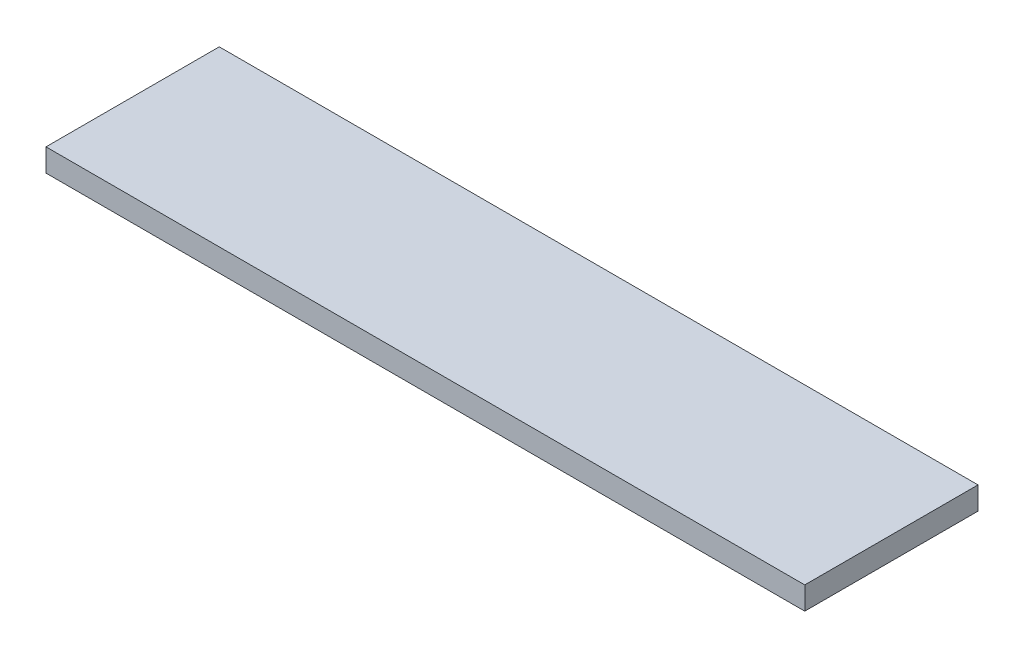
ISO-10303-21;
HEADER;
FILE_DESCRIPTION(('STEP AP214'),'2;1');
FILE_NAME('part.step','',(''),(''),'','','');
FILE_SCHEMA(('AUTOMOTIVE_DESIGN { 1 0 10303 214 1 1 1 1 }'));
ENDSEC;
DATA;
#1=APPLICATION_CONTEXT('core data for automotive mechanical design processes');
#2=APPLICATION_PROTOCOL_DEFINITION('international standard','automotive_design',2000,#1);
#3=PRODUCT_CONTEXT('',#1,'mechanical');
#4=PRODUCT('Part','Part','',(#3));
#5=PRODUCT_RELATED_PRODUCT_CATEGORY('part','',(#4));
#6=PRODUCT_DEFINITION_FORMATION('','',#4);
#7=PRODUCT_DEFINITION_CONTEXT('part definition',#1,'design');
#8=PRODUCT_DEFINITION('design','',#6,#7);
#9=PRODUCT_DEFINITION_SHAPE('','',#8);
#10=(LENGTH_UNIT() NAMED_UNIT(*) SI_UNIT(.MILLI.,.METRE.));
#11=(NAMED_UNIT(*) PLANE_ANGLE_UNIT() SI_UNIT($,.RADIAN.));
#12=(NAMED_UNIT(*) SI_UNIT($,.STERADIAN.) SOLID_ANGLE_UNIT());
#13=UNCERTAINTY_MEASURE_WITH_UNIT(LENGTH_MEASURE(1.E-05),#10,'distance_accuracy_value','');
#14=(GEOMETRIC_REPRESENTATION_CONTEXT(3) GLOBAL_UNCERTAINTY_ASSIGNED_CONTEXT((#13)) GLOBAL_UNIT_ASSIGNED_CONTEXT((#10,
#11,#12)) REPRESENTATION_CONTEXT('',''));
#15=CARTESIAN_POINT('',(0.,0.,0.));
#16=DIRECTION('',(0.,0.,1.));
#17=DIRECTION('',(1.,0.,0.));
#18=AXIS2_PLACEMENT_3D('',#15,#16,#17);
#19=CARTESIAN_POINT('',(-300.,18.,68.5));
#20=DIRECTION('',(1.,0.,0.));
#21=DIRECTION('',(0.,0.,-1.));
#22=AXIS2_PLACEMENT_3D('',#19,#20,#21);
#23=PLANE('',#22);
#24=DIRECTION('',(0.,0.,1.));
#25=VECTOR('',#24,1.);
#26=CARTESIAN_POINT('',(-300.,0.,68.5));
#27=LINE('',#26,#25);
#28=CARTESIAN_POINT('',(-300.,0.,-68.5));
#29=VERTEX_POINT('',#28);
#30=CARTESIAN_POINT('',(-300.,0.,68.5));
#31=VERTEX_POINT('',#30);
#32=EDGE_CURVE('E98',#29,#31,#27,.T.);
#33=ORIENTED_EDGE('',*,*,#32,.T.);
#34=DIRECTION('',(0.,-1.,0.));
#35=VECTOR('',#34,1.);
#36=CARTESIAN_POINT('',(-300.,18.,68.5));
#37=LINE('',#36,#35);
#38=CARTESIAN_POINT('',(-300.,18.,68.5));
#39=VERTEX_POINT('',#38);
#40=EDGE_CURVE('E11',#39,#31,#37,.T.);
#41=ORIENTED_EDGE('',*,*,#40,.F.);
#42=DIRECTION('',(0.,0.,1.));
#43=VECTOR('',#42,1.);
#44=CARTESIAN_POINT('',(-300.,18.,68.5));
#45=LINE('',#44,#43);
#46=CARTESIAN_POINT('',(-300.,18.,-68.5));
#47=VERTEX_POINT('',#46);
#48=EDGE_CURVE('E86',#47,#39,#45,.T.);
#49=ORIENTED_EDGE('',*,*,#48,.F.);
#50=DIRECTION('',(0.,-1.,0.));
#51=VECTOR('',#50,1.);
#52=CARTESIAN_POINT('',(-300.,18.,-68.5));
#53=LINE('',#52,#51);
#54=EDGE_CURVE('E94',#47,#29,#53,.T.);
#55=ORIENTED_EDGE('',*,*,#54,.T.);
#56=EDGE_LOOP('',(#33,#41,#49,#55));
#57=FACE_BOUND('',#56,.T.);
#58=ADVANCED_FACE('F35',(#57),#23,.F.);
#59=CARTESIAN_POINT('',(300.,18.,68.4999999999999));
#60=DIRECTION('',(0.,0.,-1.));
#61=DIRECTION('',(-1.,0.,0.));
#62=AXIS2_PLACEMENT_3D('',#59,#60,#61);
#63=PLANE('',#62);
#64=DIRECTION('',(1.,0.,0.));
#65=VECTOR('',#64,1.);
#66=CARTESIAN_POINT('',(300.,0.,68.4999999999999));
#67=LINE('',#66,#65);
#68=CARTESIAN_POINT('',(300.,0.,68.4999999999999));
#69=VERTEX_POINT('',#68);
#70=EDGE_CURVE('E90',#31,#69,#67,.T.);
#71=ORIENTED_EDGE('',*,*,#70,.T.);
#72=DIRECTION('',(0.,-1.,0.));
#73=VECTOR('',#72,1.);
#74=CARTESIAN_POINT('',(300.,18.,68.4999999999999));
#75=LINE('',#74,#73);
#76=CARTESIAN_POINT('',(300.,18.,68.4999999999999));
#77=VERTEX_POINT('',#76);
#78=EDGE_CURVE('E43',#77,#69,#75,.T.);
#79=ORIENTED_EDGE('',*,*,#78,.F.);
#80=DIRECTION('',(1.,0.,0.));
#81=VECTOR('',#80,1.);
#82=CARTESIAN_POINT('',(300.,18.,68.4999999999999));
#83=LINE('',#82,#81);
#84=EDGE_CURVE('E81',#39,#77,#83,.T.);
#85=ORIENTED_EDGE('',*,*,#84,.F.);
#86=ORIENTED_EDGE('',*,*,#40,.T.);
#87=EDGE_LOOP('',(#71,#79,#85,#86));
#88=FACE_BOUND('',#87,.T.);
#89=ADVANCED_FACE('F89',(#88),#63,.F.);
#90=CARTESIAN_POINT('',(300.,18.,68.4999999999999));
#91=DIRECTION('',(-1.,0.,0.));
#92=DIRECTION('',(0.,0.,1.));
#93=AXIS2_PLACEMENT_3D('',#90,#91,#92);
#94=PLANE('',#93);
#95=DIRECTION('',(0.,0.,-1.));
#96=VECTOR('',#95,1.);
#97=CARTESIAN_POINT('',(300.,0.,68.4999999999999));
#98=LINE('',#97,#96);
#99=CARTESIAN_POINT('',(300.,0.,-68.5000000000001));
#100=VERTEX_POINT('',#99);
#101=EDGE_CURVE('E68',#69,#100,#98,.T.);
#102=ORIENTED_EDGE('',*,*,#101,.T.);
#103=DIRECTION('',(0.,-1.,0.));
#104=VECTOR('',#103,1.);
#105=CARTESIAN_POINT('',(300.,18.,-68.5000000000001));
#106=LINE('',#105,#104);
#107=CARTESIAN_POINT('',(300.,18.,-68.5000000000001));
#108=VERTEX_POINT('',#107);
#109=EDGE_CURVE('E91',#108,#100,#106,.T.);
#110=ORIENTED_EDGE('',*,*,#109,.F.);
#111=DIRECTION('',(0.,0.,-1.));
#112=VECTOR('',#111,1.);
#113=CARTESIAN_POINT('',(300.,18.,68.4999999999999));
#114=LINE('',#113,#112);
#115=EDGE_CURVE('E84',#77,#108,#114,.T.);
#116=ORIENTED_EDGE('',*,*,#115,.F.);
#117=ORIENTED_EDGE('',*,*,#78,.T.);
#118=EDGE_LOOP('',(#102,#110,#116,#117));
#119=FACE_BOUND('',#118,.T.);
#120=ADVANCED_FACE('F92',(#119),#94,.F.);
#121=CARTESIAN_POINT('',(300.,18.,-68.5000000000001));
#122=DIRECTION('',(0.,0.,1.));
#123=DIRECTION('',(1.,0.,0.));
#124=AXIS2_PLACEMENT_3D('',#121,#122,#123);
#125=PLANE('',#124);
#126=DIRECTION('',(-1.,0.,0.));
#127=VECTOR('',#126,1.);
#128=CARTESIAN_POINT('',(300.,0.,-68.5000000000001));
#129=LINE('',#128,#127);
#130=EDGE_CURVE('E74',#100,#29,#129,.T.);
#131=ORIENTED_EDGE('',*,*,#130,.T.);
#132=ORIENTED_EDGE('',*,*,#54,.F.);
#133=DIRECTION('',(-1.,0.,0.));
#134=VECTOR('',#133,1.);
#135=CARTESIAN_POINT('',(300.,18.,-68.5000000000001));
#136=LINE('',#135,#134);
#137=EDGE_CURVE('E51',#108,#47,#136,.T.);
#138=ORIENTED_EDGE('',*,*,#137,.F.);
#139=ORIENTED_EDGE('',*,*,#109,.T.);
#140=EDGE_LOOP('',(#131,#132,#138,#139));
#141=FACE_BOUND('',#140,.T.);
#142=ADVANCED_FACE('F105',(#141),#125,.F.);
#143=CARTESIAN_POINT('',(0.,18.,0.));
#144=DIRECTION('',(0.,1.,0.));
#145=DIRECTION('',(0.,0.,1.));
#146=AXIS2_PLACEMENT_3D('',#143,#144,#145);
#147=PLANE('',#146);
#148=ORIENTED_EDGE('',*,*,#48,.T.);
#149=ORIENTED_EDGE('',*,*,#84,.T.);
#150=ORIENTED_EDGE('',*,*,#115,.T.);
#151=ORIENTED_EDGE('',*,*,#137,.T.);
#152=EDGE_LOOP('',(#148,#149,#150,#151));
#153=FACE_BOUND('',#152,.T.);
#154=ADVANCED_FACE('F82',(#153),#147,.T.);
#155=CARTESIAN_POINT('',(0.,0.,0.));
#156=DIRECTION('',(0.,1.,0.));
#157=DIRECTION('',(0.,0.,1.));
#158=AXIS2_PLACEMENT_3D('',#155,#156,#157);
#159=PLANE('',#158);
#160=ORIENTED_EDGE('',*,*,#32,.F.);
#161=ORIENTED_EDGE('',*,*,#130,.F.);
#162=ORIENTED_EDGE('',*,*,#101,.F.);
#163=ORIENTED_EDGE('',*,*,#70,.F.);
#164=EDGE_LOOP('',(#160,#161,#162,#163));
#165=FACE_BOUND('',#164,.T.);
#166=ADVANCED_FACE('F108',(#165),#159,.F.);
#167=CLOSED_SHELL('',(#58,#89,#120,#142,#154,#166));
#168=MANIFOLD_SOLID_BREP('B2',#167);
#169=ADVANCED_BREP_SHAPE_REPRESENTATION('',(#18,#168),#14);
#170=SHAPE_DEFINITION_REPRESENTATION(#9,#169);
ENDSEC;
END-ISO-10303-21;
